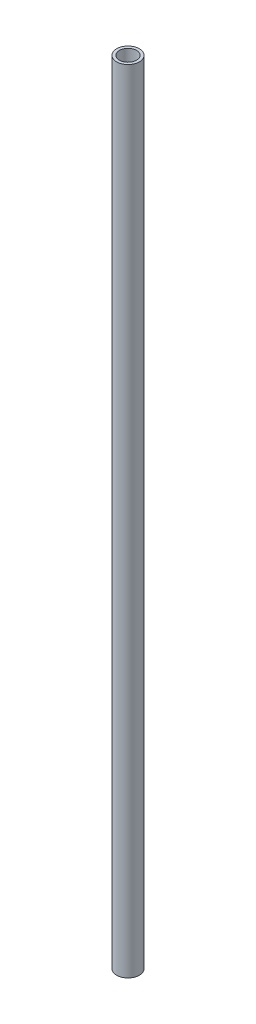
ISO-10303-21;
HEADER;
FILE_DESCRIPTION(('STEP AP214'),'2;1');
FILE_NAME('part.step','',(''),(''),'','','');
FILE_SCHEMA(('AUTOMOTIVE_DESIGN { 1 0 10303 214 1 1 1 1 }'));
ENDSEC;
DATA;
#1=APPLICATION_CONTEXT('core data for automotive mechanical design processes');
#2=APPLICATION_PROTOCOL_DEFINITION('international standard','automotive_design',2000,#1);
#3=PRODUCT_CONTEXT('',#1,'mechanical');
#4=PRODUCT('Part','Part','',(#3));
#5=PRODUCT_RELATED_PRODUCT_CATEGORY('part','',(#4));
#6=PRODUCT_DEFINITION_FORMATION('','',#4);
#7=PRODUCT_DEFINITION_CONTEXT('part definition',#1,'design');
#8=PRODUCT_DEFINITION('design','',#6,#7);
#9=PRODUCT_DEFINITION_SHAPE('','',#8);
#10=(LENGTH_UNIT() NAMED_UNIT(*) SI_UNIT(.MILLI.,.METRE.));
#11=(NAMED_UNIT(*) PLANE_ANGLE_UNIT() SI_UNIT($,.RADIAN.));
#12=(NAMED_UNIT(*) SI_UNIT($,.STERADIAN.) SOLID_ANGLE_UNIT());
#13=UNCERTAINTY_MEASURE_WITH_UNIT(LENGTH_MEASURE(1.E-05),#10,'distance_accuracy_value','');
#14=(GEOMETRIC_REPRESENTATION_CONTEXT(3) GLOBAL_UNCERTAINTY_ASSIGNED_CONTEXT((#13)) GLOBAL_UNIT_ASSIGNED_CONTEXT((#10,
#11,#12)) REPRESENTATION_CONTEXT('',''));
#15=CARTESIAN_POINT('',(0.,0.,0.));
#16=DIRECTION('',(0.,0.,1.));
#17=DIRECTION('',(1.,0.,0.));
#18=AXIS2_PLACEMENT_3D('',#15,#16,#17);
#19=CARTESIAN_POINT('',(0.,69.5,0.));
#20=DIRECTION('',(0.,1.,0.));
#21=DIRECTION('',(0.,0.,1.));
#22=AXIS2_PLACEMENT_3D('',#19,#20,#21);
#23=PLANE('',#22);
#24=CARTESIAN_POINT('',(0.,69.5,0.));
#25=DIRECTION('',(0.,1.,0.));
#26=DIRECTION('',(0.,0.,1.));
#27=AXIS2_PLACEMENT_3D('',#24,#25,#26);
#28=CIRCLE('',#27,2.);
#29=CARTESIAN_POINT('',(0.,69.5,2.));
#30=VERTEX_POINT('',#29);
#31=EDGE_CURVE('E10',#30,#30,#28,.T.);
#32=ORIENTED_EDGE('',*,*,#31,.T.);
#33=EDGE_LOOP('',(#32));
#34=FACE_BOUND('',#33,.T.);
#35=CARTESIAN_POINT('',(0.,69.5,0.));
#36=DIRECTION('',(0.,1.,0.));
#37=DIRECTION('',(0.,0.,1.));
#38=AXIS2_PLACEMENT_3D('',#35,#36,#37);
#39=CIRCLE('',#38,1.5);
#40=CARTESIAN_POINT('',(0.,69.5,1.5));
#41=VERTEX_POINT('',#40);
#42=EDGE_CURVE('E46',#41,#41,#39,.T.);
#43=ORIENTED_EDGE('',*,*,#42,.F.);
#44=EDGE_LOOP('',(#43));
#45=FACE_BOUND('',#44,.T.);
#46=ADVANCED_FACE('F35',(#34,#45),#23,.T.);
#47=CARTESIAN_POINT('',(0.,-69.5,0.));
#48=DIRECTION('',(0.,1.,0.));
#49=DIRECTION('',(0.,0.,1.));
#50=AXIS2_PLACEMENT_3D('',#47,#48,#49);
#51=PLANE('',#50);
#52=CARTESIAN_POINT('',(0.,-69.5,0.));
#53=DIRECTION('',(0.,1.,0.));
#54=DIRECTION('',(0.,0.,1.));
#55=AXIS2_PLACEMENT_3D('',#52,#53,#54);
#56=CIRCLE('',#55,2.);
#57=CARTESIAN_POINT('',(0.,-69.5,2.));
#58=VERTEX_POINT('',#57);
#59=EDGE_CURVE('E39',#58,#58,#56,.T.);
#60=ORIENTED_EDGE('',*,*,#59,.F.);
#61=EDGE_LOOP('',(#60));
#62=FACE_BOUND('',#61,.T.);
#63=CARTESIAN_POINT('',(0.,-69.5,0.));
#64=DIRECTION('',(0.,1.,0.));
#65=DIRECTION('',(0.,0.,1.));
#66=AXIS2_PLACEMENT_3D('',#63,#64,#65);
#67=CIRCLE('',#66,1.5);
#68=CARTESIAN_POINT('',(0.,-69.5,1.5));
#69=VERTEX_POINT('',#68);
#70=EDGE_CURVE('E48',#69,#69,#67,.T.);
#71=ORIENTED_EDGE('',*,*,#70,.T.);
#72=EDGE_LOOP('',(#71));
#73=FACE_BOUND('',#72,.T.);
#74=ADVANCED_FACE('F58',(#62,#73),#51,.F.);
#75=CARTESIAN_POINT('',(0.,69.5,0.));
#76=DIRECTION('',(0.,-1.,0.));
#77=DIRECTION('',(0.,0.,-1.));
#78=AXIS2_PLACEMENT_3D('',#75,#76,#77);
#79=CYLINDRICAL_SURFACE('',#78,2.);
#80=ORIENTED_EDGE('',*,*,#31,.F.);
#81=EDGE_LOOP('',(#80));
#82=FACE_BOUND('',#81,.T.);
#83=ORIENTED_EDGE('',*,*,#59,.T.);
#84=EDGE_LOOP('',(#83));
#85=FACE_BOUND('',#84,.T.);
#86=ADVANCED_FACE('F37',(#82,#85),#79,.T.);
#87=CARTESIAN_POINT('',(0.,69.5,0.));
#88=DIRECTION('',(0.,-1.,0.));
#89=DIRECTION('',(0.,0.,-1.));
#90=AXIS2_PLACEMENT_3D('',#87,#88,#89);
#91=CYLINDRICAL_SURFACE('',#90,1.5);
#92=ORIENTED_EDGE('',*,*,#42,.T.);
#93=EDGE_LOOP('',(#92));
#94=FACE_BOUND('',#93,.T.);
#95=ORIENTED_EDGE('',*,*,#70,.F.);
#96=EDGE_LOOP('',(#95));
#97=FACE_BOUND('',#96,.T.);
#98=ADVANCED_FACE('F54',(#94,#97),#91,.F.);
#99=CLOSED_SHELL('',(#46,#74,#86,#98));
#100=MANIFOLD_SOLID_BREP('B2',#99);
#101=ADVANCED_BREP_SHAPE_REPRESENTATION('',(#18,#100),#14);
#102=SHAPE_DEFINITION_REPRESENTATION(#9,#101);
ENDSEC;
END-ISO-10303-21;
